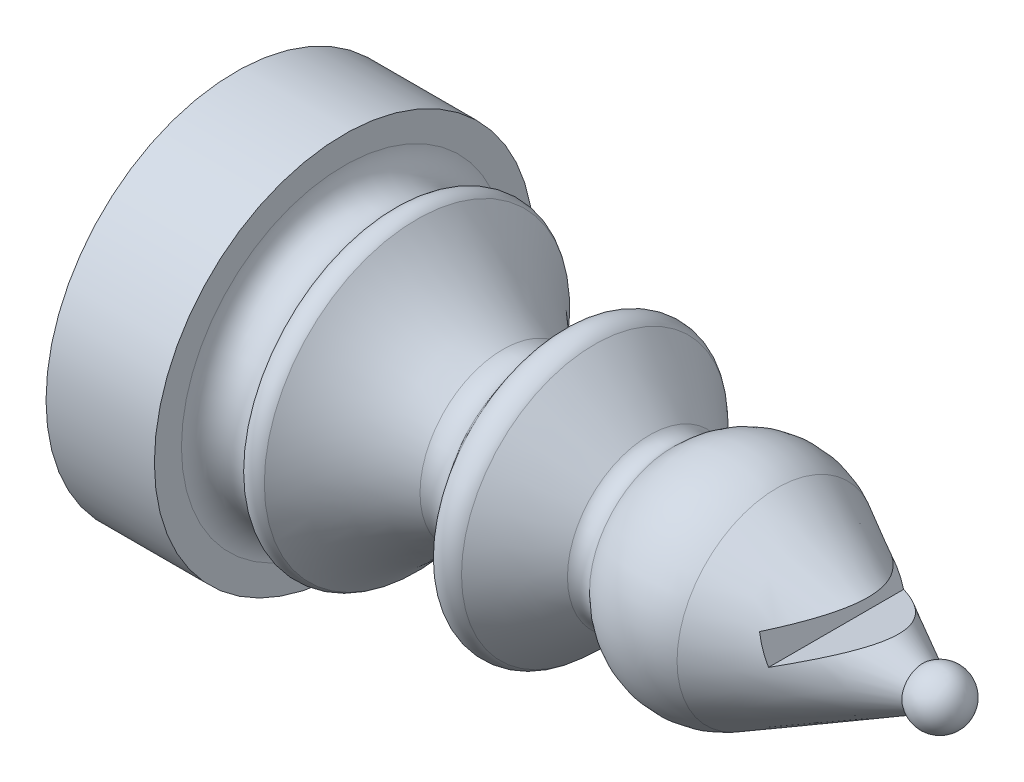
ISO-10303-21;
HEADER;
FILE_DESCRIPTION(('STEP AP214'),'2;1');
FILE_NAME('part.step','',(''),(''),'','','');
FILE_SCHEMA(('AUTOMOTIVE_DESIGN { 1 0 10303 214 1 1 1 1 }'));
ENDSEC;
DATA;
#1=APPLICATION_CONTEXT('core data for automotive mechanical design processes');
#2=APPLICATION_PROTOCOL_DEFINITION('international standard','automotive_design',2000,#1);
#3=PRODUCT_CONTEXT('',#1,'mechanical');
#4=PRODUCT('Part','Part','',(#3));
#5=PRODUCT_RELATED_PRODUCT_CATEGORY('part','',(#4));
#6=PRODUCT_DEFINITION_FORMATION('','',#4);
#7=PRODUCT_DEFINITION_CONTEXT('part definition',#1,'design');
#8=PRODUCT_DEFINITION('design','',#6,#7);
#9=PRODUCT_DEFINITION_SHAPE('','',#8);
#10=(LENGTH_UNIT() NAMED_UNIT(*) SI_UNIT(.MILLI.,.METRE.));
#11=(NAMED_UNIT(*) PLANE_ANGLE_UNIT() SI_UNIT($,.RADIAN.));
#12=(NAMED_UNIT(*) SI_UNIT($,.STERADIAN.) SOLID_ANGLE_UNIT());
#13=UNCERTAINTY_MEASURE_WITH_UNIT(LENGTH_MEASURE(1.E-05),#10,'distance_accuracy_value','');
#14=(GEOMETRIC_REPRESENTATION_CONTEXT(3) GLOBAL_UNCERTAINTY_ASSIGNED_CONTEXT((#13)) GLOBAL_UNIT_ASSIGNED_CONTEXT((#10,
#11,#12)) REPRESENTATION_CONTEXT('',''));
#15=CARTESIAN_POINT('',(0.,0.,0.));
#16=DIRECTION('',(0.,0.,1.));
#17=DIRECTION('',(1.,0.,0.));
#18=AXIS2_PLACEMENT_3D('',#15,#16,#17);
#19=CARTESIAN_POINT('',(3.,0.,0.));
#20=DIRECTION('',(-1.,0.,0.));
#21=DIRECTION('',(0.,0.,1.));
#22=AXIS2_PLACEMENT_3D('',#19,#20,#21);
#23=TOROIDAL_SURFACE('',#22,6.,1.);
#24=CARTESIAN_POINT('',(2.,0.,0.));
#25=DIRECTION('',(-1.,0.,0.));
#26=DIRECTION('',(0.,0.,1.));
#27=AXIS2_PLACEMENT_3D('',#24,#25,#26);
#28=CIRCLE('',#27,6.);
#29=CARTESIAN_POINT('',(2.,0.,6.));
#30=VERTEX_POINT('',#29);
#31=EDGE_CURVE('E71',#30,#30,#28,.T.);
#32=ORIENTED_EDGE('',*,*,#31,.F.);
#33=EDGE_LOOP('',(#32));
#34=FACE_BOUND('',#33,.T.);
#35=CARTESIAN_POINT('',(3.93105162549971,0.,0.));
#36=DIRECTION('',(-1.,0.,0.));
#37=DIRECTION('',(0.,0.,1.));
#38=AXIS2_PLACEMENT_3D('',#35,#36,#37);
#39=CIRCLE('',#38,5.63511252329745);
#40=CARTESIAN_POINT('',(3.93105162549971,0.,5.63511252329745));
#41=VERTEX_POINT('',#40);
#42=EDGE_CURVE('E116',#41,#41,#39,.T.);
#43=ORIENTED_EDGE('',*,*,#42,.T.);
#44=EDGE_LOOP('',(#43));
#45=FACE_BOUND('',#44,.T.);
#46=ADVANCED_FACE('F35',(#34,#45),#23,.F.);
#47=CARTESIAN_POINT('',(4.31222552775748,0.,0.));
#48=DIRECTION('',(-1.,0.,0.));
#49=DIRECTION('',(0.,0.,1.));
#50=AXIS2_PLACEMENT_3D('',#47,#48,#49);
#51=TOROIDAL_SURFACE('',#50,5.17174824301942,0.600000000000001);
#52=ORIENTED_EDGE('',*,*,#42,.F.);
#53=EDGE_LOOP('',(#52));
#54=FACE_BOUND('',#53,.T.);
#55=CARTESIAN_POINT('',(4.69339943001525,0.,0.));
#56=DIRECTION('',(-1.,0.,0.));
#57=DIRECTION('',(0.,0.,1.));
#58=AXIS2_PLACEMENT_3D('',#55,#56,#57);
#59=CIRCLE('',#58,5.63511252329745);
#60=CARTESIAN_POINT('',(4.69339943001525,0.,5.63511252329745));
#61=VERTEX_POINT('',#60);
#62=EDGE_CURVE('E117',#61,#61,#59,.T.);
#63=ORIENTED_EDGE('',*,*,#62,.T.);
#64=EDGE_LOOP('',(#63));
#65=FACE_BOUND('',#64,.T.);
#66=ADVANCED_FACE('F104',(#54,#65),#51,.T.);
#67=CARTESIAN_POINT('',(12.7061781570082,0.,0.));
#68=DIRECTION('',(-1.,0.,0.));
#69=DIRECTION('',(0.,0.,1.));
#70=AXIS2_PLACEMENT_3D('',#67,#68,#69);
#71=TOROIDAL_SURFACE('',#70,12.2684002772167,10.4021694542074);
#72=ORIENTED_EDGE('',*,*,#62,.F.);
#73=EDGE_LOOP('',(#72));
#74=FACE_BOUND('',#73,.T.);
#75=CARTESIAN_POINT('',(7.86797121915053,0.,0.));
#76=DIRECTION('',(-1.,0.,0.));
#77=DIRECTION('',(0.,0.,1.));
#78=AXIS2_PLACEMENT_3D('',#75,#76,#77);
#79=CIRCLE('',#78,3.0598779755381);
#80=CARTESIAN_POINT('',(7.86797121915053,0.,3.0598779755381));
#81=VERTEX_POINT('',#80);
#82=EDGE_CURVE('E119',#81,#81,#79,.T.);
#83=ORIENTED_EDGE('',*,*,#82,.T.);
#84=EDGE_LOOP('',(#83));
#85=FACE_BOUND('',#84,.T.);
#86=ADVANCED_FACE('F109',(#74,#85),#71,.F.);
#87=CARTESIAN_POINT('',(8.29242590254623,0.,0.));
#88=DIRECTION('',(-1.,0.,0.));
#89=DIRECTION('',(0.,0.,1.));
#90=AXIS2_PLACEMENT_3D('',#87,#88,#89);
#91=TOROIDAL_SURFACE('',#90,3.86773933167759,0.912579721996968);
#92=ORIENTED_EDGE('',*,*,#82,.F.);
#93=EDGE_LOOP('',(#92));
#94=FACE_BOUND('',#93,.T.);
#95=CARTESIAN_POINT('',(9.02648346709692,0.,0.));
#96=DIRECTION('',(-1.,0.,0.));
#97=DIRECTION('',(0.,0.,1.));
#98=AXIS2_PLACEMENT_3D('',#95,#96,#97);
#99=CIRCLE('',#98,3.32555740563617);
#100=CARTESIAN_POINT('',(9.02648346709692,0.,3.32555740563617));
#101=VERTEX_POINT('',#100);
#102=EDGE_CURVE('E124',#101,#101,#99,.T.);
#103=ORIENTED_EDGE('',*,*,#102,.T.);
#104=EDGE_LOOP('',(#103));
#105=FACE_BOUND('',#104,.T.);
#106=ADVANCED_FACE('F281',(#94,#105),#91,.F.);
#107=CARTESIAN_POINT('',(10.1214209172442,0.,0.));
#108=DIRECTION('',(1.,0.,0.));
#109=DIRECTION('',(0.,0.,-1.));
#110=AXIS2_PLACEMENT_3D('',#107,#108,#109);
#111=CONICAL_SURFACE('',#110,4.8079880795223,0.934625051913606);
#112=ORIENTED_EDGE('',*,*,#102,.F.);
#113=EDGE_LOOP('',(#112));
#114=FACE_BOUND('',#113,.T.);
#115=CARTESIAN_POINT('',(10.1214209172442,0.,0.));
#116=DIRECTION('',(-1.,0.,0.));
#117=DIRECTION('',(0.,0.,1.));
#118=AXIS2_PLACEMENT_3D('',#115,#116,#117);
#119=CIRCLE('',#118,4.8079880795223);
#120=CARTESIAN_POINT('',(10.1214209172442,0.,4.8079880795223));
#121=VERTEX_POINT('',#120);
#122=EDGE_CURVE('E127',#121,#121,#119,.T.);
#123=ORIENTED_EDGE('',*,*,#122,.T.);
#124=EDGE_LOOP('',(#123));
#125=FACE_BOUND('',#124,.T.);
#126=ADVANCED_FACE('F272',(#114,#125),#111,.T.);
#127=CARTESIAN_POINT('',(10.7338491301533,0.,0.));
#128=DIRECTION('',(-1.,0.,0.));
#129=DIRECTION('',(0.,0.,1.));
#130=AXIS2_PLACEMENT_3D('',#127,#128,#129);
#131=TOROIDAL_SURFACE('',#130,4.35564275393413,0.76137021845385);
#132=ORIENTED_EDGE('',*,*,#122,.F.);
#133=EDGE_LOOP('',(#132));
#134=FACE_BOUND('',#133,.T.);
#135=CARTESIAN_POINT('',(11.2524610901956,0.,0.));
#136=DIRECTION('',(-1.,0.,0.));
#137=DIRECTION('',(0.,0.,1.));
#138=AXIS2_PLACEMENT_3D('',#135,#136,#137);
#139=CIRCLE('',#138,4.91307099545905);
#140=CARTESIAN_POINT('',(11.2524610901956,0.,4.91307099545905));
#141=VERTEX_POINT('',#140);
#142=EDGE_CURVE('E130',#141,#141,#139,.T.);
#143=ORIENTED_EDGE('',*,*,#142,.T.);
#144=EDGE_LOOP('',(#143));
#145=FACE_BOUND('',#144,.T.);
#146=ADVANCED_FACE('F263',(#134,#145),#131,.T.);
#147=CARTESIAN_POINT('',(13.2789164169973,0.,0.));
#148=DIRECTION('',(-1.,0.,0.));
#149=DIRECTION('',(0.,0.,1.));
#150=AXIS2_PLACEMENT_3D('',#147,#148,#149);
#151=CONICAL_SURFACE('',#150,3.02772703424214,0.749340535062338);
#152=ORIENTED_EDGE('',*,*,#142,.F.);
#153=EDGE_LOOP('',(#152));
#154=FACE_BOUND('',#153,.T.);
#155=CARTESIAN_POINT('',(13.2789164169973,0.,0.));
#156=DIRECTION('',(-1.,0.,0.));
#157=DIRECTION('',(0.,0.,1.));
#158=AXIS2_PLACEMENT_3D('',#155,#156,#157);
#159=CIRCLE('',#158,3.02772703424214);
#160=CARTESIAN_POINT('',(13.2789164169973,0.,3.02772703424214));
#161=VERTEX_POINT('',#160);
#162=EDGE_CURVE('E133',#161,#161,#159,.T.);
#163=ORIENTED_EDGE('',*,*,#162,.T.);
#164=EDGE_LOOP('',(#163));
#165=FACE_BOUND('',#164,.T.);
#166=ADVANCED_FACE('F254',(#154,#165),#151,.T.);
#167=CARTESIAN_POINT('',(13.6876100702075,0.,0.));
#168=DIRECTION('',(-1.,0.,0.));
#169=DIRECTION('',(0.,0.,1.));
#170=AXIS2_PLACEMENT_3D('',#167,#168,#169);
#171=TOROIDAL_SURFACE('',#170,3.46700997020218,0.6);
#172=ORIENTED_EDGE('',*,*,#162,.F.);
#173=EDGE_LOOP('',(#172));
#174=FACE_BOUND('',#173,.T.);
#175=CARTESIAN_POINT('',(14.1263065166848,0.,0.));
#176=DIRECTION('',(-1.,0.,0.));
#177=DIRECTION('',(0.,0.,1.));
#178=AXIS2_PLACEMENT_3D('',#175,#176,#177);
#179=CIRCLE('',#178,3.05768683642129);
#180=CARTESIAN_POINT('',(14.1263065166848,0.,3.05768683642129));
#181=VERTEX_POINT('',#180);
#182=EDGE_CURVE('E136',#181,#181,#179,.T.);
#183=ORIENTED_EDGE('',*,*,#182,.T.);
#184=EDGE_LOOP('',(#183));
#185=FACE_BOUND('',#184,.T.);
#186=ADVANCED_FACE('F246',(#174,#185),#171,.F.);
#187=CARTESIAN_POINT('',(16.4660208978969,0.,0.));
#188=DIRECTION('',(-1.,0.,0.));
#189=DIRECTION('',(0.,0.,1.));
#190=AXIS2_PLACEMENT_3D('',#187,#188,#189);
#191=DEGENERATE_TOROIDAL_SURFACE('',#190,0.874630122923179,3.2,.T.);
#192=ORIENTED_EDGE('',*,*,#182,.F.);
#193=EDGE_LOOP('',(#192));
#194=FACE_BOUND('',#193,.T.);
#195=CARTESIAN_POINT('',(17.9871502835558,0.,0.));
#196=DIRECTION('',(-1.,0.,0.));
#197=DIRECTION('',(0.,0.,1.));
#198=AXIS2_PLACEMENT_3D('',#195,#196,#197);
#199=CIRCLE('',#198,3.68997475406248);
#200=CARTESIAN_POINT('',(17.9871502835558,0.,3.68997475406248));
#201=VERTEX_POINT('',#200);
#202=EDGE_CURVE('E139',#201,#201,#199,.T.);
#203=ORIENTED_EDGE('',*,*,#202,.T.);
#204=EDGE_LOOP('',(#203));
#205=FACE_BOUND('',#204,.T.);
#206=ADVANCED_FACE('F101',(#194,#205),#191,.T.);
#207=CARTESIAN_POINT('',(23.3737315015754,0.,0.));
#208=DIRECTION('',(-1.,0.,0.));
#209=DIRECTION('',(0.,0.,1.));
#210=AXIS2_PLACEMENT_3D('',#207,#208,#209);
#211=CONICAL_SURFACE('',#210,0.779607444731616,0.495365141872275);
#212=CARTESIAN_POINT('',(20.0422173947845,0.588916510632623,0.));
#213=DIRECTION('',(-0.921146216293932,-0.389216711110112,0.));
#214=DIRECTION('',(-0.389216711110112,0.921146216293932,0.));
#215=AXIS2_PLACEMENT_3D('',#212,#213,#214);
#216=ELLIPSE('',#215,2.800448952306,2.51149993836067);
#217=CARTESIAN_POINT('',(19.7795579219046,1.21054392978161,-2.43748868711638));
#218=VERTEX_POINT('',#217);
#219=CARTESIAN_POINT('',(20.1687746330147,0.289397713487676,-2.49451319761881));
#220=VERTEX_POINT('',#219);
#221=EDGE_CURVE('E47',#218,#220,#216,.T.);
#222=ORIENTED_EDGE('',*,*,#221,.T.);
#223=CARTESIAN_POINT('',(20.1685746330147,0.289313206445423,-2.49463178435868));
#224=CARTESIAN_POINT('',(20.2535741880757,0.325228511400776,-2.44421624234922));
#225=CARTESIAN_POINT('',(20.3381918315154,0.360982445248507,-2.39302528490799));
#226=CARTESIAN_POINT('',(20.506488960551,0.432093908221329,-2.28876316316884));
#227=CARTESIAN_POINT('',(20.5901679943434,0.467451246443457,-2.23569114057616));
#228=CARTESIAN_POINT('',(20.7577570091396,0.538263506216487,-2.12645642331241));
#229=CARTESIAN_POINT('',(20.8416464168238,0.573709734815443,-2.07025637082934));
#230=CARTESIAN_POINT('',(21.0078469545618,0.643935314141365,-1.95519896591737));
#231=CARTESIAN_POINT('',(21.0901584012741,0.678714798667678,-1.89634215475919));
#232=CARTESIAN_POINT('',(21.2550309324594,0.748379248464314,-1.77372174226074));
#233=CARTESIAN_POINT('',(21.3375348688453,0.783240066655511,-1.70986704092307));
#234=CARTESIAN_POINT('',(21.4996533469675,0.851740832059256,-1.57798037349266));
#235=CARTESIAN_POINT('',(21.5792686086012,0.885381083453769,-1.50994945970508));
#236=CARTESIAN_POINT('',(21.733989974057,0.950756308294279,-1.36909045146561));
#237=CARTESIAN_POINT('',(21.8091215771737,0.982502056090049,-1.2962956860725));
#238=CARTESIAN_POINT('',(21.953539062495,1.04352352876101,-1.14423374974294));
#239=CARTESIAN_POINT('',(22.0228328571873,1.07280259694085,-1.06497563571482));
#240=CARTESIAN_POINT('',(22.1366794354838,1.12090678495349,-0.91864391810758));
#241=CARTESIAN_POINT('',(22.1831355826893,1.14053614292765,-0.853339174013588));
#242=CARTESIAN_POINT('',(22.2689298278261,1.17678723242205,-0.717249469836736));
#243=CARTESIAN_POINT('',(22.3082614769604,1.19340623909852,-0.64645962679045));
#244=CARTESIAN_POINT('',(22.3772384873884,1.22255145477232,-0.497936023878777));
#245=CARTESIAN_POINT('',(22.4067317087374,1.23501337928598,-0.42011492494506));
#246=CARTESIAN_POINT('',(22.4401459479221,1.24913207189924,-0.299965853362625));
#247=CARTESIAN_POINT('',(22.4494762563035,1.25307445572235,-0.259384248959899));
#248=CARTESIAN_POINT('',(22.4641563000117,1.25927729109202,-0.177370912419952));
#249=CARTESIAN_POINT('',(22.4695069922087,1.26153814694989,-0.13593938710363));
#250=CARTESIAN_POINT('',(22.4755957495697,1.26411086132781,-0.0573366443217035));
#251=CARTESIAN_POINT('',(22.4767818123922,1.26461201463309,-0.0202057968655183));
#252=CARTESIAN_POINT('',(22.4757513905207,1.26417662510991,0.0540135331192452));
#253=CARTESIAN_POINT('',(22.4735337651317,1.26323960029766,0.0911019972745646));
#254=CARTESIAN_POINT('',(22.4657822722379,1.25996432161013,0.164883275978056));
#255=CARTESIAN_POINT('',(22.4602467950137,1.25762538757176,0.20157588966932));
#256=CARTESIAN_POINT('',(22.4460769933492,1.2516381474318,0.274258375840535));
#257=CARTESIAN_POINT('',(22.4374407919669,1.24798904825621,0.310247808725109));
#258=CARTESIAN_POINT('',(22.4038701150996,1.23380425521368,0.428947294407061));
#259=CARTESIAN_POINT('',(22.372609943738,1.22059573210313,0.509590782233538));
#260=CARTESIAN_POINT('',(22.298921187533,1.18945963793201,0.66451994197563));
#261=CARTESIAN_POINT('',(22.2564667597463,1.17152114731793,0.738790368331835));
#262=CARTESIAN_POINT('',(22.1668538511209,1.13365653803957,0.876792851394547));
#263=CARTESIAN_POINT('',(22.1201692124891,1.11393063439234,0.940895038131611));
#264=CARTESIAN_POINT('',(22.021971103748,1.07243847576934,1.06462356226244));
#265=CARTESIAN_POINT('',(21.970452886862,1.05067021511329,1.12424539408723));
#266=CARTESIAN_POINT('',(21.8635960166847,1.00551942489751,1.24004063451985));
#267=CARTESIAN_POINT('',(21.8082348515756,0.982127383302109,1.29618930261793));
#268=CARTESIAN_POINT('',(21.6949130966572,0.934244951646464,1.40522416708913));
#269=CARTESIAN_POINT('',(21.6369536374378,0.909755039300227,1.45811175910126));
#270=CARTESIAN_POINT('',(21.5226492588083,0.861457414527206,1.55800469181466));
#271=CARTESIAN_POINT('',(21.4664235836758,0.83770008700642,1.60517183283853));
#272=CARTESIAN_POINT('',(21.35255986212,0.789588655363131,1.69745829533896));
#273=CARTESIAN_POINT('',(21.294921651623,0.76523448191369,1.74257737716944));
#274=CARTESIAN_POINT('',(21.1202088847507,0.691412186052157,1.8753734255408));
#275=CARTESIAN_POINT('',(21.001430554936,0.64122415936991,1.96040863359528));
#276=CARTESIAN_POINT('',(20.7646116988298,0.541159853972897,2.12250768546564));
#277=CARTESIAN_POINT('',(20.646667017285,0.491324073038505,2.19973872257927));
#278=CARTESIAN_POINT('',(20.4682960583187,0.415956062207659,2.31251508662989));
#279=CARTESIAN_POINT('',(20.4086659449664,0.390760239664451,2.34955479522397));
#280=CARTESIAN_POINT('',(20.2889484153556,0.340175367997887,2.42273907074609));
#281=CARTESIAN_POINT('',(20.228861041942,0.314786336978091,2.45888372022301));
#282=CARTESIAN_POINT('',(20.1685746330147,0.289313206445424,2.49463178435868));
#283=B_SPLINE_CURVE_WITH_KNOTS('',3,(#223,#224,#225,#226,#227,#228,#229,#230,#231,#232,#233,
#234,#235,#236,#237,#238,#239,#240,#241,#242,#243,#244,#245,#246,#247,#248,#249,#250,#251,#252,
#253,#254,#255,#256,#257,#258,#259,#260,#261,#262,#263,#264,#265,#266,#267,#268,#269,#270,#271,
#272,#273,#274,#275,#276,#277,#278,#279,#280,#281,#282),.UNSPECIFIED.,.F.,.F.,(4,2,2,2,2,2,2,2,
2,2,2,2,2,2,2,2,2,2,2,2,2,2,2,2,2,2,2,2,2,4),(0.,0.31545864779276,0.631063134823921,
0.952070923986316,1.27301360571359,1.602913611983,1.93273082990501,2.26044649873136,
2.58771058987014,2.83483678979281,3.08218557223042,3.33319893888208,3.45848267475565,
3.5837362773078,3.69501637761836,3.80633377992652,3.91770523376877,4.02914421736808,
4.29002243698077,4.55150827204904,4.79628766956754,5.04131001830847,5.28791379308106,
5.534411285929,5.76577955976657,5.99717483688698,6.4603557371977,6.90886239993995,
7.1326032772099,7.35632344203057),.UNSPECIFIED.);
#284=CARTESIAN_POINT('',(20.1687746330147,0.289397713487676,2.49451319761881));
#285=VERTEX_POINT('',#284);
#286=EDGE_CURVE('E11',#220,#285,#283,.T.);
#287=ORIENTED_EDGE('',*,*,#286,.T.);
#288=CARTESIAN_POINT('',(19.7795579219046,1.21054392978161,2.43748868711638));
#289=VERTEX_POINT('',#288);
#290=EDGE_CURVE('E60',#285,#289,#216,.T.);
#291=ORIENTED_EDGE('',*,*,#290,.T.);
#292=CARTESIAN_POINT('',(19.7793579219046,1.21045942273936,2.4376513043415));
#293=CARTESIAN_POINT('',(19.8353606548604,1.23412254934041,2.39210842878548));
#294=CARTESIAN_POINT('',(19.8909086926833,1.25759355123738,2.3458955741879));
#295=CARTESIAN_POINT('',(20.0009331198843,1.30408274582934,2.25194973995927));
#296=CARTESIAN_POINT('',(20.0554091302348,1.32710077837183,2.20421623776982));
#297=CARTESIAN_POINT('',(20.1635696874557,1.37280242226799,2.1066459053176));
#298=CARTESIAN_POINT('',(20.2172427953921,1.39548120026927,2.05679407973147));
#299=CARTESIAN_POINT('',(20.3230417506622,1.44018498418622,1.95519793580308));
#300=CARTESIAN_POINT('',(20.3751677534383,1.46221005578177,1.90345380876016));
#301=CARTESIAN_POINT('',(20.4796129204521,1.50634181649182,1.79573828228224));
#302=CARTESIAN_POINT('',(20.5318569019702,1.52841673826003,1.73968059423277));
#303=CARTESIAN_POINT('',(20.633893209032,1.57153067082135,1.62499748578957));
#304=CARTESIAN_POINT('',(20.6836858908544,1.59256983215477,1.56637244089696));
#305=CARTESIAN_POINT('',(20.7800803951979,1.63329990441259,1.44645103834691));
#306=CARTESIAN_POINT('',(20.8266927047831,1.65299524649082,1.38516467154982));
#307=CARTESIAN_POINT('',(20.9161509913227,1.69079452249348,1.25945542923511));
#308=CARTESIAN_POINT('',(20.9589989198795,1.70889928103858,1.19503420619197));
#309=CARTESIAN_POINT('',(21.0283356155836,1.73819647640655,1.0817950693387));
#310=CARTESIAN_POINT('',(21.0559850797464,1.74987934858799,1.03381838417763));
#311=CARTESIAN_POINT('',(21.1084692337249,1.77205575167751,0.936086662185213));
#312=CARTESIAN_POINT('',(21.1333034074859,1.78254906453427,0.886331301506554));
#313=CARTESIAN_POINT('',(21.2025746387523,1.81181859887219,0.734944295054456));
#314=CARTESIAN_POINT('',(21.2421904078166,1.8285576562233,0.630544116520241));
#315=CARTESIAN_POINT('',(21.2889258175254,1.84830501243827,0.468690643687678));
#316=CARTESIAN_POINT('',(21.3024493500997,1.85401918113163,0.413364845485543));
#317=CARTESIAN_POINT('',(21.3245539320002,1.86335914531496,0.301539723488873));
#318=CARTESIAN_POINT('',(21.3331352688993,1.86698506231456,0.245040468172833));
#319=CARTESIAN_POINT('',(21.3449830940279,1.87199118560835,0.131413919185225));
#320=CARTESIAN_POINT('',(21.3482522269479,1.87337250937736,0.0742869522918957));
#321=CARTESIAN_POINT('',(21.3493367920462,1.87383077632032,-0.040026131001899));
#322=CARTESIAN_POINT('',(21.3471527967429,1.87290796140341,-0.0972122405629406));
#323=CARTESIAN_POINT('',(21.338158654241,1.8691076195012,-0.202549968507993));
#324=CARTESIAN_POINT('',(21.3320863091098,1.86654183986829,-0.250778109103797));
#325=CARTESIAN_POINT('',(21.3162620433787,1.85985553040446,-0.346525464950922));
#326=CARTESIAN_POINT('',(21.3065089233316,1.85573449376485,-0.394044443856107));
#327=CARTESIAN_POINT('',(21.2721260932897,1.8412065374091,-0.535110636948563));
#328=CARTESIAN_POINT('',(21.2423693737434,1.82863327562899,-0.627204611124909));
#329=CARTESIAN_POINT('',(21.1521648068019,1.79051866987907,-0.85636120792784));
#330=CARTESIAN_POINT('',(21.0838616838354,1.76165819538617,-0.989724527288325));
#331=CARTESIAN_POINT('',(20.9682681218448,1.71281584524928,-1.18049854569088));
#332=CARTESIAN_POINT('',(20.9273519506611,1.69552732221394,-1.24278079341694));
#333=CARTESIAN_POINT('',(20.8419553575483,1.65944425470147,-1.3644020901828));
#334=CARTESIAN_POINT('',(20.7974757166149,1.64065004022257,-1.42374177954443));
#335=CARTESIAN_POINT('',(20.6792475192226,1.59069446385962,-1.57309807967174));
#336=CARTESIAN_POINT('',(20.6033801217202,1.55863781702761,-1.66112666119265));
#337=CARTESIAN_POINT('',(20.4464448506557,1.49232713911305,-1.83163352457092));
#338=CARTESIAN_POINT('',(20.3653719322664,1.45807097641334,-1.91410625854578));
#339=CARTESIAN_POINT('',(20.2015426632804,1.38884734163053,-2.07224202767948));
#340=CARTESIAN_POINT('',(20.1188851921526,1.35392164960468,-2.14802649344667));
#341=CARTESIAN_POINT('',(19.9928942353615,1.30068603405916,-2.25876644805856));
#342=CARTESIAN_POINT('',(19.9506139747817,1.28282113522264,-2.29514927763227));
#343=CARTESIAN_POINT('',(19.8654337516333,1.24682949163882,-2.36703821072547));
#344=CARTESIAN_POINT('',(19.822533867002,1.22870277982277,-2.40254442301109));
#345=CARTESIAN_POINT('',(19.7793579219046,1.21045942273936,-2.4376513043415));
#346=B_SPLINE_CURVE_WITH_KNOTS('',3,(#292,#293,#294,#295,#296,#297,#298,#299,#300,#301,#302,
#303,#304,#305,#306,#307,#308,#309,#310,#311,#312,#313,#314,#315,#316,#317,#318,#319,#320,#321,
#322,#323,#324,#325,#326,#327,#328,#329,#330,#331,#332,#333,#334,#335,#336,#337,#338,#339,#340,
#341,#342,#343,#344,#345),.UNSPECIFIED.,.F.,.F.,(4,2,2,2,2,2,2,2,2,2,2,2,2,2,2,2,2,2,2,2,2,2,2,
2,2,2,4),(0.,0.22789474700408,0.455868671421341,0.685881887490881,0.915871914655983,
1.15503301892547,1.39415925960573,1.63245452771046,1.870625516076,2.04029609897736,
2.20999773310212,2.54706011461913,2.7185671649409,2.89006423472921,3.06147589820087,
3.23286956609608,3.37872497481177,3.52462795425401,3.8163221811313,4.27137057038965,
4.50078411143662,4.73014750938536,5.09144414569075,5.45309637069538,5.80532695683652,
5.98102984308949,6.15671081835201),.UNSPECIFIED.);
#347=EDGE_CURVE('E67',#289,#218,#346,.T.);
#348=ORIENTED_EDGE('',*,*,#347,.T.);
#349=EDGE_LOOP('',(#222,#287,#291,#348));
#350=FACE_BOUND('',#349,.T.);
#351=ORIENTED_EDGE('',*,*,#202,.F.);
#352=EDGE_LOOP('',(#351));
#353=FACE_BOUND('',#352,.T.);
#354=CARTESIAN_POINT('',(23.3737315015754,0.,0.));
#355=DIRECTION('',(-1.,0.,0.));
#356=DIRECTION('',(0.,0.,1.));
#357=AXIS2_PLACEMENT_3D('',#354,#355,#356);
#358=CIRCLE('',#357,0.779607444731616);
#359=CARTESIAN_POINT('',(23.3737315015754,0.,0.779607444731616));
#360=VERTEX_POINT('',#359);
#361=EDGE_CURVE('E142',#360,#360,#358,.T.);
#362=ORIENTED_EDGE('',*,*,#361,.T.);
#363=EDGE_LOOP('',(#362));
#364=FACE_BOUND('',#363,.T.);
#365=ADVANCED_FACE('F77',(#350,#353,#364),#211,.T.);
#366=CARTESIAN_POINT('',(24.,0.,0.));
#367=DIRECTION('',(-1.,0.,0.));
#368=DIRECTION('',(0.,1.,0.));
#369=AXIS2_PLACEMENT_3D('',#366,#367,#368);
#370=SPHERICAL_SURFACE('',#369,0.999999999999997);
#371=ORIENTED_EDGE('',*,*,#361,.F.);
#372=EDGE_LOOP('',(#371));
#373=FACE_BOUND('',#372,.T.);
#374=ADVANCED_FACE('F92',(#373),#370,.T.);
#375=CARTESIAN_POINT('',(20.1687746330147,0.289397713487676,-5.));
#376=DIRECTION('',(0.389216711110113,-0.921146216293932,0.));
#377=DIRECTION('',(0.921146216293932,0.389216711110113,0.));
#378=AXIS2_PLACEMENT_3D('',#375,#376,#377);
#379=PLANE('',#378);
#380=DIRECTION('',(0.,0.,1.));
#381=VECTOR('',#380,1.);
#382=CARTESIAN_POINT('',(20.1687746330147,0.289397713487676,-5.));
#383=LINE('',#382,#381);
#384=EDGE_CURVE('E74',#220,#285,#383,.T.);
#385=ORIENTED_EDGE('',*,*,#384,.T.);
#386=ORIENTED_EDGE('',*,*,#286,.F.);
#387=EDGE_LOOP('',(#385,#386));
#388=FACE_BOUND('',#387,.T.);
#389=ADVANCED_FACE('F94',(#388),#379,.F.);
#390=CARTESIAN_POINT('',(19.7795579219046,1.21054392978161,-5.));
#391=DIRECTION('',(-0.921146216293932,-0.389216711110112,0.));
#392=DIRECTION('',(0.389216711110112,-0.921146216293932,0.));
#393=AXIS2_PLACEMENT_3D('',#390,#391,#392);
#394=PLANE('',#393);
#395=DIRECTION('',(0.,0.,1.));
#396=VECTOR('',#395,1.);
#397=CARTESIAN_POINT('',(19.7795579219046,1.21054392978161,-5.));
#398=LINE('',#397,#396);
#399=EDGE_CURVE('E53',#218,#289,#398,.T.);
#400=ORIENTED_EDGE('',*,*,#399,.T.);
#401=ORIENTED_EDGE('',*,*,#290,.F.);
#402=ORIENTED_EDGE('',*,*,#384,.F.);
#403=ORIENTED_EDGE('',*,*,#221,.F.);
#404=EDGE_LOOP('',(#400,#401,#402,#403));
#405=FACE_BOUND('',#404,.T.);
#406=ADVANCED_FACE('F73',(#405),#394,.F.);
#407=CARTESIAN_POINT('',(23.022896676787,2.58096875578826,-5.));
#408=DIRECTION('',(-0.389216711110113,0.921146216293931,0.));
#409=DIRECTION('',(-0.921146216293932,-0.389216711110114,0.));
#410=AXIS2_PLACEMENT_3D('',#407,#408,#409);
#411=PLANE('',#410);
#412=ORIENTED_EDGE('',*,*,#399,.F.);
#413=ORIENTED_EDGE('',*,*,#347,.F.);
#414=EDGE_LOOP('',(#412,#413));
#415=FACE_BOUND('',#414,.T.);
#416=ADVANCED_FACE('F68',(#415),#411,.F.);
#417=CARTESIAN_POINT('',(2.,0.,0.));
#418=DIRECTION('',(-1.,0.,0.));
#419=DIRECTION('',(0.,0.,1.));
#420=AXIS2_PLACEMENT_3D('',#417,#418,#419);
#421=CYLINDRICAL_SURFACE('',#420,7.);
#422=CARTESIAN_POINT('',(2.,0.,0.));
#423=DIRECTION('',(-1.,0.,0.));
#424=DIRECTION('',(0.,0.,1.));
#425=AXIS2_PLACEMENT_3D('',#422,#423,#424);
#426=CIRCLE('',#425,7.);
#427=CARTESIAN_POINT('',(2.,0.,7.));
#428=VERTEX_POINT('',#427);
#429=EDGE_CURVE('E75',#428,#428,#426,.T.);
#430=ORIENTED_EDGE('',*,*,#429,.T.);
#431=EDGE_LOOP('',(#430));
#432=FACE_BOUND('',#431,.T.);
#433=CARTESIAN_POINT('',(-2.,0.,0.));
#434=DIRECTION('',(-1.,0.,0.));
#435=DIRECTION('',(0.,0.,1.));
#436=AXIS2_PLACEMENT_3D('',#433,#434,#435);
#437=CIRCLE('',#436,7.);
#438=CARTESIAN_POINT('',(-2.,0.,7.));
#439=VERTEX_POINT('',#438);
#440=EDGE_CURVE('E148',#439,#439,#437,.T.);
#441=ORIENTED_EDGE('',*,*,#440,.F.);
#442=EDGE_LOOP('',(#441));
#443=FACE_BOUND('',#442,.T.);
#444=ADVANCED_FACE('F91',(#432,#443),#421,.T.);
#445=CARTESIAN_POINT('',(2.,0.,0.));
#446=DIRECTION('',(-1.,0.,0.));
#447=DIRECTION('',(0.,0.,1.));
#448=AXIS2_PLACEMENT_3D('',#445,#446,#447);
#449=PLANE('',#448);
#450=ORIENTED_EDGE('',*,*,#31,.T.);
#451=EDGE_LOOP('',(#450));
#452=FACE_BOUND('',#451,.T.);
#453=ORIENTED_EDGE('',*,*,#429,.F.);
#454=EDGE_LOOP('',(#453));
#455=FACE_BOUND('',#454,.T.);
#456=ADVANCED_FACE('F169',(#452,#455),#449,.F.);
#457=CARTESIAN_POINT('',(-2.,0.,0.));
#458=DIRECTION('',(-1.,0.,0.));
#459=DIRECTION('',(0.,0.,1.));
#460=AXIS2_PLACEMENT_3D('',#457,#458,#459);
#461=PLANE('',#460);
#462=CARTESIAN_POINT('',(-2.,0.,0.));
#463=DIRECTION('',(-1.,0.,0.));
#464=DIRECTION('',(0.,0.,1.));
#465=AXIS2_PLACEMENT_3D('',#462,#463,#464);
#466=CIRCLE('',#465,6.05);
#467=CARTESIAN_POINT('',(-2.,0.,6.05));
#468=VERTEX_POINT('',#467);
#469=EDGE_CURVE('E152',#468,#468,#466,.T.);
#470=ORIENTED_EDGE('',*,*,#469,.F.);
#471=EDGE_LOOP('',(#470));
#472=FACE_BOUND('',#471,.T.);
#473=ORIENTED_EDGE('',*,*,#440,.T.);
#474=EDGE_LOOP('',(#473));
#475=FACE_BOUND('',#474,.T.);
#476=ADVANCED_FACE('F163',(#472,#475),#461,.T.);
#477=CARTESIAN_POINT('',(1.2,0.,0.));
#478=DIRECTION('',(-1.,0.,0.));
#479=DIRECTION('',(0.,0.,1.));
#480=AXIS2_PLACEMENT_3D('',#477,#478,#479);
#481=CYLINDRICAL_SURFACE('',#480,6.05);
#482=CARTESIAN_POINT('',(1.2,0.,0.));
#483=DIRECTION('',(-1.,0.,0.));
#484=DIRECTION('',(0.,0.,1.));
#485=AXIS2_PLACEMENT_3D('',#482,#483,#484);
#486=CIRCLE('',#485,6.05);
#487=CARTESIAN_POINT('',(1.2,0.,6.05));
#488=VERTEX_POINT('',#487);
#489=EDGE_CURVE('E151',#488,#488,#486,.T.);
#490=ORIENTED_EDGE('',*,*,#489,.F.);
#491=EDGE_LOOP('',(#490));
#492=FACE_BOUND('',#491,.T.);
#493=ORIENTED_EDGE('',*,*,#469,.T.);
#494=EDGE_LOOP('',(#493));
#495=FACE_BOUND('',#494,.T.);
#496=ADVANCED_FACE('F160',(#492,#495),#481,.F.);
#497=CARTESIAN_POINT('',(1.2,0.,0.));
#498=DIRECTION('',(-1.,0.,0.));
#499=DIRECTION('',(0.,0.,1.));
#500=AXIS2_PLACEMENT_3D('',#497,#498,#499);
#501=PLANE('',#500);
#502=ORIENTED_EDGE('',*,*,#489,.T.);
#503=EDGE_LOOP('',(#502));
#504=FACE_BOUND('',#503,.T.);
#505=ADVANCED_FACE('F158',(#504),#501,.T.);
#506=CLOSED_SHELL('',(#46,#66,#86,#106,#126,#146,#166,#186,#206,#365,#374,#389,#406,#416,#444,
#456,#476,#496,#505));
#507=MANIFOLD_SOLID_BREP('B2',#506);
#508=ADVANCED_BREP_SHAPE_REPRESENTATION('',(#18,#507),#14);
#509=SHAPE_DEFINITION_REPRESENTATION(#9,#508);
ENDSEC;
END-ISO-10303-21;
